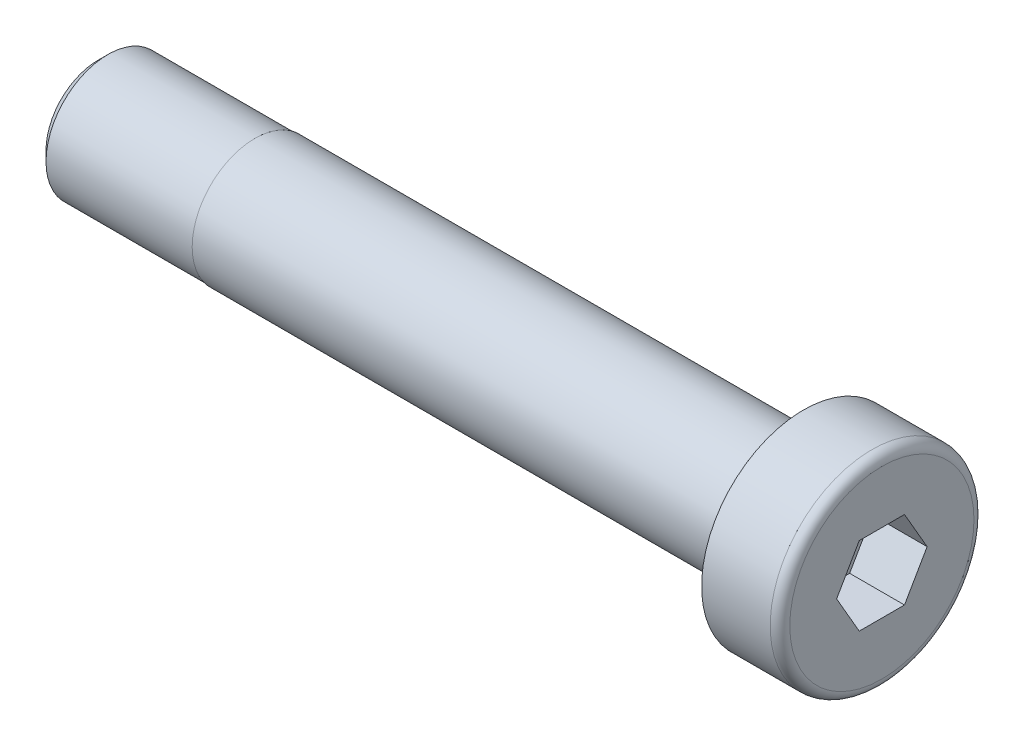
ISO-10303-21;
HEADER;
FILE_DESCRIPTION(('STEP AP214'),'2;1');
FILE_NAME('part.step','',(''),(''),'','','');
FILE_SCHEMA(('AUTOMOTIVE_DESIGN { 1 0 10303 214 1 1 1 1 }'));
ENDSEC;
DATA;
#1=APPLICATION_CONTEXT('core data for automotive mechanical design processes');
#2=APPLICATION_PROTOCOL_DEFINITION('international standard','automotive_design',2000,#1);
#3=PRODUCT_CONTEXT('',#1,'mechanical');
#4=PRODUCT('Part','Part','',(#3));
#5=PRODUCT_RELATED_PRODUCT_CATEGORY('part','',(#4));
#6=PRODUCT_DEFINITION_FORMATION('','',#4);
#7=PRODUCT_DEFINITION_CONTEXT('part definition',#1,'design');
#8=PRODUCT_DEFINITION('design','',#6,#7);
#9=PRODUCT_DEFINITION_SHAPE('','',#8);
#10=(LENGTH_UNIT() NAMED_UNIT(*) SI_UNIT(.MILLI.,.METRE.));
#11=(NAMED_UNIT(*) PLANE_ANGLE_UNIT() SI_UNIT($,.RADIAN.));
#12=(NAMED_UNIT(*) SI_UNIT($,.STERADIAN.) SOLID_ANGLE_UNIT());
#13=UNCERTAINTY_MEASURE_WITH_UNIT(LENGTH_MEASURE(1.E-05),#10,'distance_accuracy_value','');
#14=(GEOMETRIC_REPRESENTATION_CONTEXT(3) GLOBAL_UNCERTAINTY_ASSIGNED_CONTEXT((#13)) GLOBAL_UNIT_ASSIGNED_CONTEXT((#10,
#11,#12)) REPRESENTATION_CONTEXT('',''));
#15=CARTESIAN_POINT('',(0.,0.,0.));
#16=DIRECTION('',(0.,0.,1.));
#17=DIRECTION('',(1.,0.,0.));
#18=AXIS2_PLACEMENT_3D('',#15,#16,#17);
#19=CARTESIAN_POINT('',(-123.158940217391,0.,0.));
#20=DIRECTION('',(-1.,0.,0.));
#21=DIRECTION('',(0.,0.,-1.));
#22=AXIS2_PLACEMENT_3D('',#19,#20,#21);
#23=CYLINDRICAL_SURFACE('',#22,4.);
#24=CARTESIAN_POINT('',(-5.,0.,0.));
#25=DIRECTION('',(1.,0.,0.));
#26=DIRECTION('',(0.,0.,-1.));
#27=AXIS2_PLACEMENT_3D('',#24,#25,#26);
#28=CIRCLE('',#27,4.);
#29=CARTESIAN_POINT('',(-5.,0.,-4.));
#30=VERTEX_POINT('',#29);
#31=EDGE_CURVE('E147',#30,#30,#28,.T.);
#32=ORIENTED_EDGE('',*,*,#31,.F.);
#33=EDGE_LOOP('',(#32));
#34=FACE_BOUND('',#33,.T.);
#35=CARTESIAN_POINT('',(-40.,0.,0.));
#36=DIRECTION('',(-1.,0.,0.));
#37=DIRECTION('',(0.,0.,1.));
#38=AXIS2_PLACEMENT_3D('',#35,#36,#37);
#39=CIRCLE('',#38,4.);
#40=CARTESIAN_POINT('',(-40.,0.,4.));
#41=VERTEX_POINT('',#40);
#42=EDGE_CURVE('E140',#41,#41,#39,.T.);
#43=ORIENTED_EDGE('',*,*,#42,.F.);
#44=EDGE_LOOP('',(#43));
#45=FACE_BOUND('',#44,.T.);
#46=ADVANCED_FACE('F39',(#34,#45),#23,.T.);
#47=CARTESIAN_POINT('',(0.,0.,0.));
#48=DIRECTION('',(-1.,0.,0.));
#49=DIRECTION('',(0.,0.,-1.));
#50=AXIS2_PLACEMENT_3D('',#47,#48,#49);
#51=PLANE('',#50);
#52=DIRECTION('',(0.,0.866025403784438,-0.5));
#53=VECTOR('',#52,1.);
#54=CARTESIAN_POINT('',(0.,0.,2.88675134594813));
#55=LINE('',#54,#53);
#56=CARTESIAN_POINT('',(0.,0.,2.88675134594813));
#57=VERTEX_POINT('',#56);
#58=CARTESIAN_POINT('',(0.,2.5,1.44337567297406));
#59=VERTEX_POINT('',#58);
#60=EDGE_CURVE('E106',#57,#59,#55,.T.);
#61=ORIENTED_EDGE('',*,*,#60,.T.);
#62=DIRECTION('',(0.,0.,-1.));
#63=VECTOR('',#62,1.);
#64=CARTESIAN_POINT('',(0.,2.5,1.44337567297406));
#65=LINE('',#64,#63);
#66=CARTESIAN_POINT('',(0.,2.5,-1.44337567297406));
#67=VERTEX_POINT('',#66);
#68=EDGE_CURVE('E110',#59,#67,#65,.T.);
#69=ORIENTED_EDGE('',*,*,#68,.T.);
#70=DIRECTION('',(0.,-0.866025403784439,-0.5));
#71=VECTOR('',#70,1.);
#72=CARTESIAN_POINT('',(0.,2.5,-1.44337567297406));
#73=LINE('',#72,#71);
#74=CARTESIAN_POINT('',(0.,0.,-2.88675134594813));
#75=VERTEX_POINT('',#74);
#76=EDGE_CURVE('E115',#67,#75,#73,.T.);
#77=ORIENTED_EDGE('',*,*,#76,.T.);
#78=DIRECTION('',(0.,-0.866025403784439,0.5));
#79=VECTOR('',#78,1.);
#80=CARTESIAN_POINT('',(0.,0.,-2.88675134594813));
#81=LINE('',#80,#79);
#82=CARTESIAN_POINT('',(0.,-2.5,-1.44337567297406));
#83=VERTEX_POINT('',#82);
#84=EDGE_CURVE('E126',#75,#83,#81,.T.);
#85=ORIENTED_EDGE('',*,*,#84,.T.);
#86=DIRECTION('',(0.,0.,1.));
#87=VECTOR('',#86,1.);
#88=CARTESIAN_POINT('',(0.,-2.5,-1.44337567297406));
#89=LINE('',#88,#87);
#90=CARTESIAN_POINT('',(0.,-2.5,1.44337567297407));
#91=VERTEX_POINT('',#90);
#92=EDGE_CURVE('E129',#83,#91,#89,.T.);
#93=ORIENTED_EDGE('',*,*,#92,.T.);
#94=DIRECTION('',(0.,0.866025403784439,0.5));
#95=VECTOR('',#94,1.);
#96=CARTESIAN_POINT('',(0.,-2.5,1.44337567297407));
#97=LINE('',#96,#95);
#98=EDGE_CURVE('E120',#91,#57,#97,.T.);
#99=ORIENTED_EDGE('',*,*,#98,.T.);
#100=EDGE_LOOP('',(#61,#69,#77,#85,#93,#99));
#101=FACE_BOUND('',#100,.T.);
#102=CARTESIAN_POINT('',(0.,0.,0.));
#103=DIRECTION('',(1.,0.,0.));
#104=DIRECTION('',(0.,0.,-1.));
#105=AXIS2_PLACEMENT_3D('',#102,#103,#104);
#106=CIRCLE('',#105,5.875);
#107=CARTESIAN_POINT('',(0.,0.,-5.875));
#108=VERTEX_POINT('',#107);
#109=EDGE_CURVE('E12',#108,#108,#106,.F.);
#110=ORIENTED_EDGE('',*,*,#109,.F.);
#111=EDGE_LOOP('',(#110));
#112=FACE_BOUND('',#111,.T.);
#113=ADVANCED_FACE('F117',(#101,#112),#51,.F.);
#114=CARTESIAN_POINT('',(-123.158940217391,0.,0.));
#115=DIRECTION('',(-1.,0.,0.));
#116=DIRECTION('',(0.,0.,-1.));
#117=AXIS2_PLACEMENT_3D('',#114,#115,#116);
#118=CYLINDRICAL_SURFACE('',#117,6.5);
#119=CARTESIAN_POINT('',(-0.625000000000001,0.,0.));
#120=DIRECTION('',(1.,0.,0.));
#121=DIRECTION('',(0.,0.,-1.));
#122=AXIS2_PLACEMENT_3D('',#119,#120,#121);
#123=CIRCLE('',#122,6.5);
#124=CARTESIAN_POINT('',(-0.625000000000001,0.,-6.5));
#125=VERTEX_POINT('',#124);
#126=EDGE_CURVE('E47',#125,#125,#123,.T.);
#127=ORIENTED_EDGE('',*,*,#126,.F.);
#128=EDGE_LOOP('',(#127));
#129=FACE_BOUND('',#128,.T.);
#130=CARTESIAN_POINT('',(-5.,0.,0.));
#131=DIRECTION('',(1.,0.,0.));
#132=DIRECTION('',(0.,0.,-1.));
#133=AXIS2_PLACEMENT_3D('',#130,#131,#132);
#134=CIRCLE('',#133,6.5);
#135=CARTESIAN_POINT('',(-5.,0.,-6.5));
#136=VERTEX_POINT('',#135);
#137=EDGE_CURVE('E150',#136,#136,#134,.T.);
#138=ORIENTED_EDGE('',*,*,#137,.T.);
#139=EDGE_LOOP('',(#138));
#140=FACE_BOUND('',#139,.T.);
#141=ADVANCED_FACE('F162',(#129,#140),#118,.T.);
#142=CARTESIAN_POINT('',(-5.,6.5,0.));
#143=DIRECTION('',(1.,0.,0.));
#144=DIRECTION('',(0.,0.,1.));
#145=AXIS2_PLACEMENT_3D('',#142,#143,#144);
#146=PLANE('',#145);
#147=ORIENTED_EDGE('',*,*,#31,.T.);
#148=EDGE_LOOP('',(#147));
#149=FACE_BOUND('',#148,.T.);
#150=ORIENTED_EDGE('',*,*,#137,.F.);
#151=EDGE_LOOP('',(#150));
#152=FACE_BOUND('',#151,.T.);
#153=ADVANCED_FACE('F165',(#149,#152),#146,.F.);
#154=CARTESIAN_POINT('',(-40.,0.,-4.));
#155=DIRECTION('',(-1.,0.,0.));
#156=DIRECTION('',(0.,0.,-1.));
#157=AXIS2_PLACEMENT_3D('',#154,#155,#156);
#158=PLANE('',#157);
#159=CARTESIAN_POINT('',(-40.,0.,0.));
#160=DIRECTION('',(-1.,0.,0.));
#161=DIRECTION('',(0.,0.,1.));
#162=AXIS2_PLACEMENT_3D('',#159,#160,#161);
#163=CIRCLE('',#162,3.95);
#164=CARTESIAN_POINT('',(-40.,0.,3.95));
#165=VERTEX_POINT('',#164);
#166=EDGE_CURVE('E144',#165,#165,#163,.T.);
#167=ORIENTED_EDGE('',*,*,#166,.F.);
#168=EDGE_LOOP('',(#167));
#169=FACE_BOUND('',#168,.T.);
#170=ORIENTED_EDGE('',*,*,#42,.T.);
#171=EDGE_LOOP('',(#170));
#172=FACE_BOUND('',#171,.T.);
#173=ADVANCED_FACE('F170',(#169,#172),#158,.T.);
#174=CARTESIAN_POINT('',(0.,0.,0.));
#175=DIRECTION('',(1.,0.,0.));
#176=DIRECTION('',(0.,0.,1.));
#177=AXIS2_PLACEMENT_3D('',#174,#175,#176);
#178=CYLINDRICAL_SURFACE('',#177,3.95);
#179=CARTESIAN_POINT('',(-49.375,0.,0.));
#180=DIRECTION('',(-1.,0.,0.));
#181=DIRECTION('',(0.,0.,1.));
#182=AXIS2_PLACEMENT_3D('',#179,#180,#181);
#183=CIRCLE('',#182,3.95);
#184=CARTESIAN_POINT('',(-49.375,0.,3.95));
#185=VERTEX_POINT('',#184);
#186=EDGE_CURVE('E153',#185,#185,#183,.T.);
#187=ORIENTED_EDGE('',*,*,#186,.F.);
#188=EDGE_LOOP('',(#187));
#189=FACE_BOUND('',#188,.T.);
#190=ORIENTED_EDGE('',*,*,#166,.T.);
#191=EDGE_LOOP('',(#190));
#192=FACE_BOUND('',#191,.T.);
#193=ADVANCED_FACE('F176',(#189,#192),#178,.T.);
#194=CARTESIAN_POINT('',(-50.,3.99999999999999,0.));
#195=DIRECTION('',(1.,0.,0.));
#196=DIRECTION('',(0.,0.,1.));
#197=AXIS2_PLACEMENT_3D('',#194,#195,#196);
#198=PLANE('',#197);
#199=CARTESIAN_POINT('',(-50.,0.,0.));
#200=DIRECTION('',(-1.,0.,0.));
#201=DIRECTION('',(0.,0.,1.));
#202=AXIS2_PLACEMENT_3D('',#199,#200,#201);
#203=CIRCLE('',#202,3.32499999999999);
#204=CARTESIAN_POINT('',(-50.,0.,3.32499999999999));
#205=VERTEX_POINT('',#204);
#206=EDGE_CURVE('E156',#205,#205,#203,.F.);
#207=ORIENTED_EDGE('',*,*,#206,.F.);
#208=EDGE_LOOP('',(#207));
#209=FACE_BOUND('',#208,.T.);
#210=ADVANCED_FACE('F189',(#209),#198,.F.);
#211=CARTESIAN_POINT('',(-49.375,0.,0.));
#212=DIRECTION('',(1.,0.,0.));
#213=DIRECTION('',(0.,0.,1.));
#214=AXIS2_PLACEMENT_3D('',#211,#212,#213);
#215=CONICAL_SURFACE('',#214,3.95,0.785398163397446);
#216=ORIENTED_EDGE('',*,*,#206,.T.);
#217=EDGE_LOOP('',(#216));
#218=FACE_BOUND('',#217,.T.);
#219=ORIENTED_EDGE('',*,*,#186,.T.);
#220=EDGE_LOOP('',(#219));
#221=FACE_BOUND('',#220,.T.);
#222=ADVANCED_FACE('F191',(#218,#221),#215,.T.);
#223=CARTESIAN_POINT('',(-0.625000000000001,0.,0.));
#224=DIRECTION('',(-1.,0.,0.));
#225=DIRECTION('',(0.,0.,-1.));
#226=AXIS2_PLACEMENT_3D('',#223,#224,#225);
#227=TOROIDAL_SURFACE('',#226,5.875,0.625);
#228=ORIENTED_EDGE('',*,*,#109,.T.);
#229=EDGE_LOOP('',(#228));
#230=FACE_BOUND('',#229,.T.);
#231=ORIENTED_EDGE('',*,*,#126,.T.);
#232=EDGE_LOOP('',(#231));
#233=FACE_BOUND('',#232,.T.);
#234=ADVANCED_FACE('F41',(#230,#233),#227,.T.);
#235=CARTESIAN_POINT('',(-12.6376261582597,-2.5,1.44337567297407));
#236=DIRECTION('',(0.,-0.5,0.866025403784439));
#237=DIRECTION('',(0.,0.866025403784439,0.5));
#238=AXIS2_PLACEMENT_3D('',#235,#236,#237);
#239=PLANE('',#238);
#240=DIRECTION('',(0.,-0.866025403784439,-0.5));
#241=VECTOR('',#240,1.);
#242=CARTESIAN_POINT('',(-3.5,-2.5,1.44337567297407));
#243=LINE('',#242,#241);
#244=CARTESIAN_POINT('',(-3.5,0.,2.88675134594813));
#245=VERTEX_POINT('',#244);
#246=CARTESIAN_POINT('',(-3.5,-2.5,1.44337567297407));
#247=VERTEX_POINT('',#246);
#248=EDGE_CURVE('E141',#245,#247,#243,.T.);
#249=ORIENTED_EDGE('',*,*,#248,.F.);
#250=DIRECTION('',(1.,0.,0.));
#251=VECTOR('',#250,1.);
#252=CARTESIAN_POINT('',(-12.6376261582597,0.,2.88675134594813));
#253=LINE('',#252,#251);
#254=EDGE_CURVE('E54',#245,#57,#253,.T.);
#255=ORIENTED_EDGE('',*,*,#254,.T.);
#256=ORIENTED_EDGE('',*,*,#98,.F.);
#257=DIRECTION('',(1.,0.,0.));
#258=VECTOR('',#257,1.);
#259=CARTESIAN_POINT('',(-12.6376261582597,-2.5,1.44337567297407));
#260=LINE('',#259,#258);
#261=EDGE_CURVE('E131',#247,#91,#260,.T.);
#262=ORIENTED_EDGE('',*,*,#261,.F.);
#263=EDGE_LOOP('',(#249,#255,#256,#262));
#264=FACE_BOUND('',#263,.T.);
#265=ADVANCED_FACE('F197',(#264),#239,.F.);
#266=CARTESIAN_POINT('',(-12.6376261582597,-2.5,-1.44337567297406));
#267=DIRECTION('',(0.,-1.,0.));
#268=DIRECTION('',(0.,0.,1.));
#269=AXIS2_PLACEMENT_3D('',#266,#267,#268);
#270=PLANE('',#269);
#271=DIRECTION('',(0.,0.,-1.));
#272=VECTOR('',#271,1.);
#273=CARTESIAN_POINT('',(-3.5,-2.5,-1.44337567297406));
#274=LINE('',#273,#272);
#275=CARTESIAN_POINT('',(-3.5,-2.5,-1.44337567297406));
#276=VERTEX_POINT('',#275);
#277=EDGE_CURVE('E76',#247,#276,#274,.T.);
#278=ORIENTED_EDGE('',*,*,#277,.F.);
#279=ORIENTED_EDGE('',*,*,#261,.T.);
#280=ORIENTED_EDGE('',*,*,#92,.F.);
#281=DIRECTION('',(1.,0.,0.));
#282=VECTOR('',#281,1.);
#283=CARTESIAN_POINT('',(-12.6376261582597,-2.5,-1.44337567297406));
#284=LINE('',#283,#282);
#285=EDGE_CURVE('E133',#276,#83,#284,.T.);
#286=ORIENTED_EDGE('',*,*,#285,.F.);
#287=EDGE_LOOP('',(#278,#279,#280,#286));
#288=FACE_BOUND('',#287,.T.);
#289=ADVANCED_FACE('F200',(#288),#270,.F.);
#290=CARTESIAN_POINT('',(-12.6376261582597,0.,-2.88675134594813));
#291=DIRECTION('',(0.,-0.5,-0.866025403784438));
#292=DIRECTION('',(0.,-0.866025403784439,0.5));
#293=AXIS2_PLACEMENT_3D('',#290,#291,#292);
#294=PLANE('',#293);
#295=DIRECTION('',(0.,0.866025403784439,-0.5));
#296=VECTOR('',#295,1.);
#297=CARTESIAN_POINT('',(-3.5,0.,-2.88675134594813));
#298=LINE('',#297,#296);
#299=CARTESIAN_POINT('',(-3.5,0.,-2.88675134594813));
#300=VERTEX_POINT('',#299);
#301=EDGE_CURVE('E220',#276,#300,#298,.T.);
#302=ORIENTED_EDGE('',*,*,#301,.F.);
#303=ORIENTED_EDGE('',*,*,#285,.T.);
#304=ORIENTED_EDGE('',*,*,#84,.F.);
#305=DIRECTION('',(1.,0.,0.));
#306=VECTOR('',#305,1.);
#307=CARTESIAN_POINT('',(-12.6376261582597,0.,-2.88675134594813));
#308=LINE('',#307,#306);
#309=EDGE_CURVE('E135',#300,#75,#308,.T.);
#310=ORIENTED_EDGE('',*,*,#309,.F.);
#311=EDGE_LOOP('',(#302,#303,#304,#310));
#312=FACE_BOUND('',#311,.T.);
#313=ADVANCED_FACE('F209',(#312),#294,.F.);
#314=CARTESIAN_POINT('',(-12.6376261582597,2.5,-1.44337567297406));
#315=DIRECTION('',(0.,0.5,-0.866025403784439));
#316=DIRECTION('',(0.,-0.866025403784439,-0.5));
#317=AXIS2_PLACEMENT_3D('',#314,#315,#316);
#318=PLANE('',#317);
#319=DIRECTION('',(0.,0.866025403784439,0.5));
#320=VECTOR('',#319,1.);
#321=CARTESIAN_POINT('',(-3.5,2.5,-1.44337567297406));
#322=LINE('',#321,#320);
#323=CARTESIAN_POINT('',(-3.5,2.5,-1.44337567297406));
#324=VERTEX_POINT('',#323);
#325=EDGE_CURVE('E224',#300,#324,#322,.T.);
#326=ORIENTED_EDGE('',*,*,#325,.F.);
#327=ORIENTED_EDGE('',*,*,#309,.T.);
#328=ORIENTED_EDGE('',*,*,#76,.F.);
#329=DIRECTION('',(1.,0.,0.));
#330=VECTOR('',#329,1.);
#331=CARTESIAN_POINT('',(-12.6376261582597,2.5,-1.44337567297406));
#332=LINE('',#331,#330);
#333=EDGE_CURVE('E107',#324,#67,#332,.T.);
#334=ORIENTED_EDGE('',*,*,#333,.F.);
#335=EDGE_LOOP('',(#326,#327,#328,#334));
#336=FACE_BOUND('',#335,.T.);
#337=ADVANCED_FACE('F206',(#336),#318,.F.);
#338=CARTESIAN_POINT('',(-12.6376261582597,2.5,1.44337567297406));
#339=DIRECTION('',(0.,1.,0.));
#340=DIRECTION('',(0.,0.,-1.));
#341=AXIS2_PLACEMENT_3D('',#338,#339,#340);
#342=PLANE('',#341);
#343=DIRECTION('',(0.,0.,1.));
#344=VECTOR('',#343,1.);
#345=CARTESIAN_POINT('',(-3.5,2.5,1.44337567297406));
#346=LINE('',#345,#344);
#347=CARTESIAN_POINT('',(-3.5,2.5,1.44337567297406));
#348=VERTEX_POINT('',#347);
#349=EDGE_CURVE('E63',#324,#348,#346,.T.);
#350=ORIENTED_EDGE('',*,*,#349,.F.);
#351=ORIENTED_EDGE('',*,*,#333,.T.);
#352=ORIENTED_EDGE('',*,*,#68,.F.);
#353=DIRECTION('',(1.,0.,0.));
#354=VECTOR('',#353,1.);
#355=CARTESIAN_POINT('',(-12.6376261582597,2.5,1.44337567297406));
#356=LINE('',#355,#354);
#357=EDGE_CURVE('E102',#348,#59,#356,.T.);
#358=ORIENTED_EDGE('',*,*,#357,.F.);
#359=EDGE_LOOP('',(#350,#351,#352,#358));
#360=FACE_BOUND('',#359,.T.);
#361=ADVANCED_FACE('F111',(#360),#342,.F.);
#362=CARTESIAN_POINT('',(-12.6376261582597,0.,2.88675134594813));
#363=DIRECTION('',(0.,0.5,0.866025403784438));
#364=DIRECTION('',(0.,0.866025403784439,-0.5));
#365=AXIS2_PLACEMENT_3D('',#362,#363,#364);
#366=PLANE('',#365);
#367=DIRECTION('',(0.,-0.866025403784439,0.5));
#368=VECTOR('',#367,1.);
#369=CARTESIAN_POINT('',(-3.5,0.,2.88675134594813));
#370=LINE('',#369,#368);
#371=EDGE_CURVE('E85',#348,#245,#370,.T.);
#372=ORIENTED_EDGE('',*,*,#371,.F.);
#373=ORIENTED_EDGE('',*,*,#357,.T.);
#374=ORIENTED_EDGE('',*,*,#60,.F.);
#375=ORIENTED_EDGE('',*,*,#254,.F.);
#376=EDGE_LOOP('',(#372,#373,#374,#375));
#377=FACE_BOUND('',#376,.T.);
#378=ADVANCED_FACE('F104',(#377),#366,.F.);
#379=CARTESIAN_POINT('',(-3.5,6.5,0.));
#380=DIRECTION('',(1.,0.,0.));
#381=DIRECTION('',(0.,0.,1.));
#382=AXIS2_PLACEMENT_3D('',#379,#380,#381);
#383=PLANE('',#382);
#384=ORIENTED_EDGE('',*,*,#248,.T.);
#385=ORIENTED_EDGE('',*,*,#277,.T.);
#386=ORIENTED_EDGE('',*,*,#301,.T.);
#387=ORIENTED_EDGE('',*,*,#325,.T.);
#388=ORIENTED_EDGE('',*,*,#349,.T.);
#389=ORIENTED_EDGE('',*,*,#371,.T.);
#390=EDGE_LOOP('',(#384,#385,#386,#387,#388,#389));
#391=FACE_BOUND('',#390,.T.);
#392=ADVANCED_FACE('F203',(#391),#383,.T.);
#393=CLOSED_SHELL('',(#46,#113,#141,#153,#173,#193,#210,#222,#234,#265,#289,#313,#337,#361,#378,#392));
#394=MANIFOLD_SOLID_BREP('B2',#393);
#395=ADVANCED_BREP_SHAPE_REPRESENTATION('',(#18,#394),#14);
#396=SHAPE_DEFINITION_REPRESENTATION(#9,#395);
ENDSEC;
END-ISO-10303-21;
